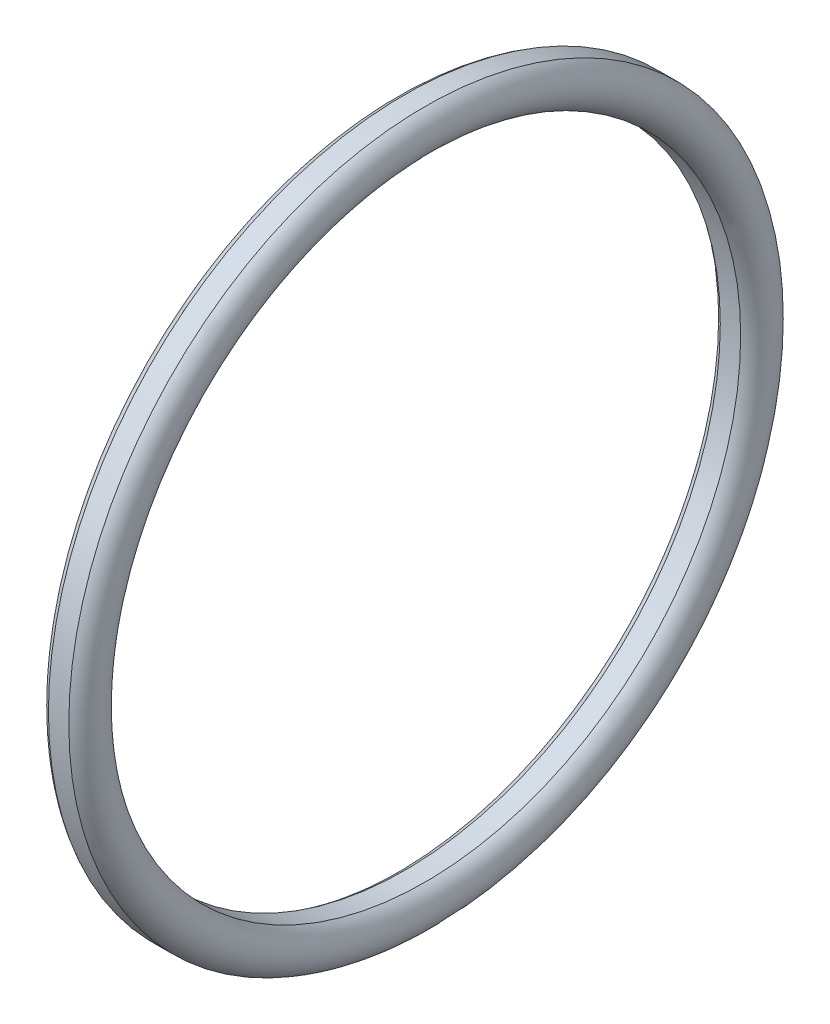
ISO-10303-21;
HEADER;
FILE_DESCRIPTION(('STEP AP214'),'2;1');
FILE_NAME('part.step','',(''),(''),'','','');
FILE_SCHEMA(('AUTOMOTIVE_DESIGN { 1 0 10303 214 1 1 1 1 }'));
ENDSEC;
DATA;
#1=APPLICATION_CONTEXT('core data for automotive mechanical design processes');
#2=APPLICATION_PROTOCOL_DEFINITION('international standard','automotive_design',2000,#1);
#3=PRODUCT_CONTEXT('',#1,'mechanical');
#4=PRODUCT('Part','Part','',(#3));
#5=PRODUCT_RELATED_PRODUCT_CATEGORY('part','',(#4));
#6=PRODUCT_DEFINITION_FORMATION('','',#4);
#7=PRODUCT_DEFINITION_CONTEXT('part definition',#1,'design');
#8=PRODUCT_DEFINITION('design','',#6,#7);
#9=PRODUCT_DEFINITION_SHAPE('','',#8);
#10=(LENGTH_UNIT() NAMED_UNIT(*) SI_UNIT(.MILLI.,.METRE.));
#11=(NAMED_UNIT(*) PLANE_ANGLE_UNIT() SI_UNIT($,.RADIAN.));
#12=(NAMED_UNIT(*) SI_UNIT($,.STERADIAN.) SOLID_ANGLE_UNIT());
#13=UNCERTAINTY_MEASURE_WITH_UNIT(LENGTH_MEASURE(1.E-05),#10,'distance_accuracy_value','');
#14=(GEOMETRIC_REPRESENTATION_CONTEXT(3) GLOBAL_UNCERTAINTY_ASSIGNED_CONTEXT((#13)) GLOBAL_UNIT_ASSIGNED_CONTEXT((#10,
#11,#12)) REPRESENTATION_CONTEXT('',''));
#15=CARTESIAN_POINT('',(0.,0.,0.));
#16=DIRECTION('',(0.,0.,1.));
#17=DIRECTION('',(1.,0.,0.));
#18=AXIS2_PLACEMENT_3D('',#15,#16,#17);
#19=CARTESIAN_POINT('',(0.,0.,0.));
#20=DIRECTION('',(1.,0.,0.));
#21=DIRECTION('',(0.,0.,-1.));
#22=AXIS2_PLACEMENT_3D('',#19,#20,#21);
#23=TOROIDAL_SURFACE('',#22,11.075,0.754);
#24=CARTESIAN_POINT('',(-0.335992559441431,0.,0.));
#25=DIRECTION('',(1.,0.,0.));
#26=DIRECTION('',(0.,0.,-1.));
#27=AXIS2_PLACEMENT_3D('',#24,#25,#26);
#28=CIRCLE('',#27,10.4);
#29=CARTESIAN_POINT('',(-0.335992559441431,0.,-10.4));
#30=VERTEX_POINT('',#29);
#31=EDGE_CURVE('E10',#30,#30,#28,.T.);
#32=ORIENTED_EDGE('',*,*,#31,.T.);
#33=EDGE_LOOP('',(#32));
#34=FACE_BOUND('',#33,.T.);
#35=CARTESIAN_POINT('',(-0.335992559441431,0.,0.));
#36=DIRECTION('',(1.,0.,0.));
#37=DIRECTION('',(0.,0.,-1.));
#38=AXIS2_PLACEMENT_3D('',#35,#36,#37);
#39=CIRCLE('',#38,11.75);
#40=CARTESIAN_POINT('',(-0.335992559441431,0.,-11.75));
#41=VERTEX_POINT('',#40);
#42=EDGE_CURVE('E53',#41,#41,#39,.T.);
#43=ORIENTED_EDGE('',*,*,#42,.F.);
#44=EDGE_LOOP('',(#43));
#45=FACE_BOUND('',#44,.T.);
#46=ADVANCED_FACE('F35',(#34,#45),#23,.T.);
#47=CARTESIAN_POINT('',(88.99,0.,0.));
#48=DIRECTION('',(1.,0.,0.));
#49=DIRECTION('',(0.,0.,-1.));
#50=AXIS2_PLACEMENT_3D('',#47,#48,#49);
#51=CYLINDRICAL_SURFACE('',#50,10.4);
#52=CARTESIAN_POINT('',(0.335992559441431,0.,0.));
#53=DIRECTION('',(1.,0.,0.));
#54=DIRECTION('',(0.,0.,-1.));
#55=AXIS2_PLACEMENT_3D('',#52,#53,#54);
#56=CIRCLE('',#55,10.4);
#57=CARTESIAN_POINT('',(0.335992559441431,0.,-10.4));
#58=VERTEX_POINT('',#57);
#59=EDGE_CURVE('E42',#58,#58,#56,.T.);
#60=ORIENTED_EDGE('',*,*,#59,.T.);
#61=EDGE_LOOP('',(#60));
#62=FACE_BOUND('',#61,.T.);
#63=ORIENTED_EDGE('',*,*,#31,.F.);
#64=EDGE_LOOP('',(#63));
#65=FACE_BOUND('',#64,.T.);
#66=ADVANCED_FACE('F63',(#62,#65),#51,.F.);
#67=CARTESIAN_POINT('',(0.,0.,0.));
#68=DIRECTION('',(1.,0.,0.));
#69=DIRECTION('',(0.,0.,-1.));
#70=AXIS2_PLACEMENT_3D('',#67,#68,#69);
#71=TOROIDAL_SURFACE('',#70,11.075,0.754);
#72=CARTESIAN_POINT('',(0.335992559441431,0.,0.));
#73=DIRECTION('',(1.,0.,0.));
#74=DIRECTION('',(0.,0.,-1.));
#75=AXIS2_PLACEMENT_3D('',#72,#73,#74);
#76=CIRCLE('',#75,11.75);
#77=CARTESIAN_POINT('',(0.335992559441431,0.,-11.75));
#78=VERTEX_POINT('',#77);
#79=EDGE_CURVE('E48',#78,#78,#76,.T.);
#80=ORIENTED_EDGE('',*,*,#79,.T.);
#81=EDGE_LOOP('',(#80));
#82=FACE_BOUND('',#81,.T.);
#83=ORIENTED_EDGE('',*,*,#59,.F.);
#84=EDGE_LOOP('',(#83));
#85=FACE_BOUND('',#84,.T.);
#86=ADVANCED_FACE('F67',(#82,#85),#71,.T.);
#87=CARTESIAN_POINT('',(88.99,0.,0.));
#88=DIRECTION('',(1.,0.,0.));
#89=DIRECTION('',(0.,0.,-1.));
#90=AXIS2_PLACEMENT_3D('',#87,#88,#89);
#91=CYLINDRICAL_SURFACE('',#90,11.75);
#92=ORIENTED_EDGE('',*,*,#42,.T.);
#93=EDGE_LOOP('',(#92));
#94=FACE_BOUND('',#93,.T.);
#95=ORIENTED_EDGE('',*,*,#79,.F.);
#96=EDGE_LOOP('',(#95));
#97=FACE_BOUND('',#96,.T.);
#98=ADVANCED_FACE('F59',(#94,#97),#91,.T.);
#99=CLOSED_SHELL('',(#46,#66,#86,#98));
#100=MANIFOLD_SOLID_BREP('B2',#99);
#101=ADVANCED_BREP_SHAPE_REPRESENTATION('',(#18,#100),#14);
#102=SHAPE_DEFINITION_REPRESENTATION(#9,#101);
ENDSEC;
END-ISO-10303-21;
